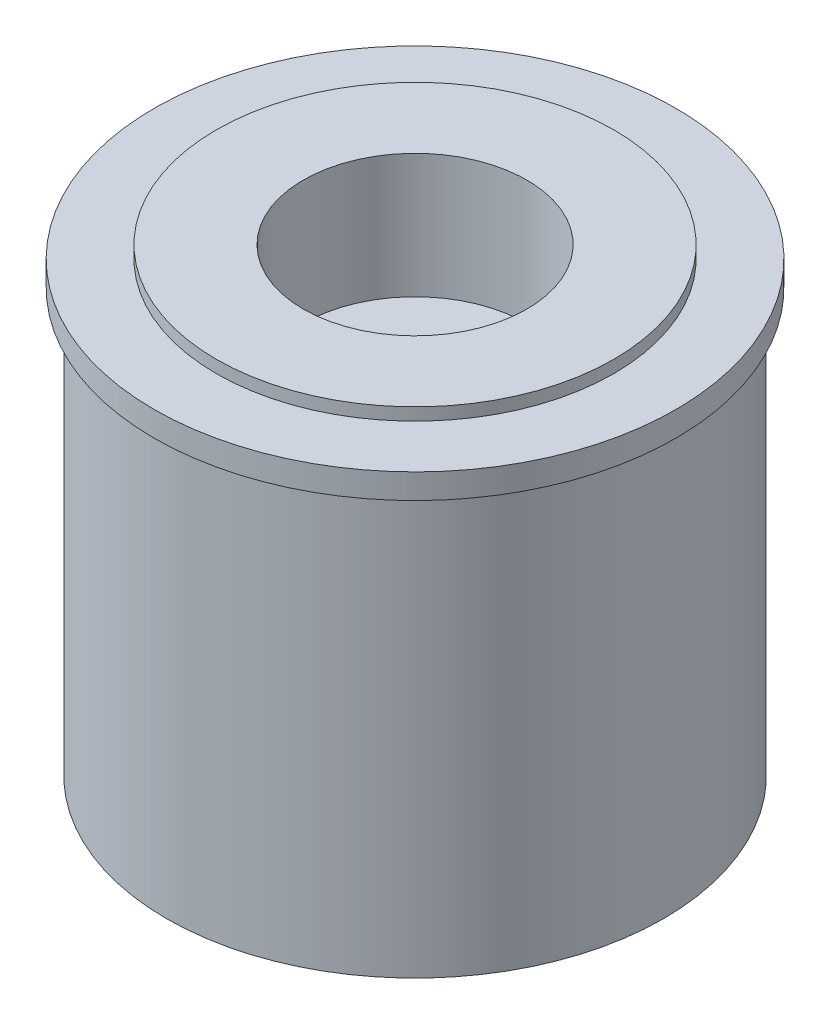
ISO-10303-21;
HEADER;
FILE_DESCRIPTION(('STEP AP214'),'2;1');
FILE_NAME('part.step','',(''),(''),'','','');
FILE_SCHEMA(('AUTOMOTIVE_DESIGN { 1 0 10303 214 1 1 1 1 }'));
ENDSEC;
DATA;
#1=APPLICATION_CONTEXT('core data for automotive mechanical design processes');
#2=APPLICATION_PROTOCOL_DEFINITION('international standard','automotive_design',2000,#1);
#3=PRODUCT_CONTEXT('',#1,'mechanical');
#4=PRODUCT('Part','Part','',(#3));
#5=PRODUCT_RELATED_PRODUCT_CATEGORY('part','',(#4));
#6=PRODUCT_DEFINITION_FORMATION('','',#4);
#7=PRODUCT_DEFINITION_CONTEXT('part definition',#1,'design');
#8=PRODUCT_DEFINITION('design','',#6,#7);
#9=PRODUCT_DEFINITION_SHAPE('','',#8);
#10=(LENGTH_UNIT() NAMED_UNIT(*) SI_UNIT(.MILLI.,.METRE.));
#11=(NAMED_UNIT(*) PLANE_ANGLE_UNIT() SI_UNIT($,.RADIAN.));
#12=(NAMED_UNIT(*) SI_UNIT($,.STERADIAN.) SOLID_ANGLE_UNIT());
#13=UNCERTAINTY_MEASURE_WITH_UNIT(LENGTH_MEASURE(1.E-05),#10,'distance_accuracy_value','');
#14=(GEOMETRIC_REPRESENTATION_CONTEXT(3) GLOBAL_UNCERTAINTY_ASSIGNED_CONTEXT((#13)) GLOBAL_UNIT_ASSIGNED_CONTEXT((#10,
#11,#12)) REPRESENTATION_CONTEXT('',''));
#15=CARTESIAN_POINT('',(0.,0.,0.));
#16=DIRECTION('',(0.,0.,1.));
#17=DIRECTION('',(1.,0.,0.));
#18=AXIS2_PLACEMENT_3D('',#15,#16,#17);
#19=CARTESIAN_POINT('',(0.,8.,0.));
#20=DIRECTION('',(0.,1.,0.));
#21=DIRECTION('',(0.,0.,1.));
#22=AXIS2_PLACEMENT_3D('',#19,#20,#21);
#23=PLANE('',#22);
#24=CARTESIAN_POINT('',(0.,8.,0.));
#25=DIRECTION('',(0.,1.,0.));
#26=DIRECTION('',(0.,0.,1.));
#27=AXIS2_PLACEMENT_3D('',#24,#25,#26);
#28=CIRCLE('',#27,8.);
#29=CARTESIAN_POINT('',(0.,8.,-8.));
#30=VERTEX_POINT('',#29);
#31=CARTESIAN_POINT('',(-8.,8.,0.));
#32=VERTEX_POINT('',#31);
#33=EDGE_CURVE('E283',#30,#32,#28,.T.);
#34=ORIENTED_EDGE('',*,*,#33,.F.);
#35=CARTESIAN_POINT('',(0.,8.,-6.));
#36=DIRECTION('',(0.,-1.,0.));
#37=DIRECTION('',(-1.,0.,0.));
#38=AXIS2_PLACEMENT_3D('',#35,#36,#37);
#39=CIRCLE('',#38,2.);
#40=EDGE_CURVE('E237',#30,#30,#39,.T.);
#41=ORIENTED_EDGE('',*,*,#40,.F.);
#42=CARTESIAN_POINT('',(8.,8.,0.));
#43=VERTEX_POINT('',#42);
#44=EDGE_CURVE('E279',#43,#30,#28,.T.);
#45=ORIENTED_EDGE('',*,*,#44,.F.);
#46=CARTESIAN_POINT('',(6.,8.,0.));
#47=DIRECTION('',(0.,-1.,0.));
#48=DIRECTION('',(0.,0.,-1.));
#49=AXIS2_PLACEMENT_3D('',#46,#47,#48);
#50=CIRCLE('',#49,2.);
#51=EDGE_CURVE('E260',#43,#43,#50,.T.);
#52=ORIENTED_EDGE('',*,*,#51,.F.);
#53=CARTESIAN_POINT('',(0.,8.,8.));
#54=VERTEX_POINT('',#53);
#55=EDGE_CURVE('E284',#54,#43,#28,.T.);
#56=ORIENTED_EDGE('',*,*,#55,.F.);
#57=CARTESIAN_POINT('',(0.,8.,6.));
#58=DIRECTION('',(0.,-1.,0.));
#59=DIRECTION('',(1.,0.,0.));
#60=AXIS2_PLACEMENT_3D('',#57,#58,#59);
#61=CIRCLE('',#60,2.);
#62=EDGE_CURVE('E254',#54,#54,#61,.T.);
#63=ORIENTED_EDGE('',*,*,#62,.F.);
#64=EDGE_CURVE('E655',#32,#54,#28,.T.);
#65=ORIENTED_EDGE('',*,*,#64,.F.);
#66=CARTESIAN_POINT('',(-6.,8.,0.));
#67=DIRECTION('',(0.,-1.,0.));
#68=DIRECTION('',(0.,0.,1.));
#69=AXIS2_PLACEMENT_3D('',#66,#67,#68);
#70=CIRCLE('',#69,2.);
#71=EDGE_CURVE('E248',#32,#32,#70,.T.);
#72=ORIENTED_EDGE('',*,*,#71,.F.);
#73=EDGE_LOOP('',(#34,#41,#45,#52,#56,#63,#65,#72));
#74=FACE_BOUND('',#73,.T.);
#75=ADVANCED_FACE('F31',(#74),#23,.F.);
#76=CARTESIAN_POINT('',(0.,17.,0.));
#77=DIRECTION('',(0.,-1.,0.));
#78=DIRECTION('',(0.,0.,-1.));
#79=AXIS2_PLACEMENT_3D('',#76,#77,#78);
#80=CYLINDRICAL_SURFACE('',#79,8.);
#81=CARTESIAN_POINT('',(0.,0.,0.));
#82=DIRECTION('',(0.,1.,0.));
#83=DIRECTION('',(0.,0.,1.));
#84=AXIS2_PLACEMENT_3D('',#81,#82,#83);
#85=CIRCLE('',#84,8.);
#86=CARTESIAN_POINT('',(0.,0.,8.));
#87=VERTEX_POINT('',#86);
#88=EDGE_CURVE('E287',#87,#87,#85,.T.);
#89=ORIENTED_EDGE('',*,*,#88,.F.);
#90=EDGE_LOOP('',(#89));
#91=FACE_BOUND('',#90,.T.);
#92=ORIENTED_EDGE('',*,*,#44,.T.);
#93=ORIENTED_EDGE('',*,*,#33,.T.);
#94=ORIENTED_EDGE('',*,*,#64,.T.);
#95=ORIENTED_EDGE('',*,*,#55,.T.);
#96=EDGE_LOOP('',(#92,#93,#94,#95));
#97=FACE_BOUND('',#96,.T.);
#98=ADVANCED_FACE('F350',(#91,#97),#80,.F.);
#99=CARTESIAN_POINT('',(0.,0.,0.));
#100=DIRECTION('',(0.,1.,0.));
#101=DIRECTION('',(0.,0.,1.));
#102=AXIS2_PLACEMENT_3D('',#99,#100,#101);
#103=PLANE('',#102);
#104=CARTESIAN_POINT('',(0.,0.,0.));
#105=DIRECTION('',(0.,1.,0.));
#106=DIRECTION('',(0.,0.,1.));
#107=AXIS2_PLACEMENT_3D('',#104,#105,#106);
#108=CIRCLE('',#107,10.);
#109=CARTESIAN_POINT('',(0.,0.,10.));
#110=VERTEX_POINT('',#109);
#111=EDGE_CURVE('E290',#110,#110,#108,.T.);
#112=ORIENTED_EDGE('',*,*,#111,.F.);
#113=EDGE_LOOP('',(#112));
#114=FACE_BOUND('',#113,.T.);
#115=ORIENTED_EDGE('',*,*,#88,.T.);
#116=EDGE_LOOP('',(#115));
#117=FACE_BOUND('',#116,.T.);
#118=ADVANCED_FACE('F357',(#114,#117),#103,.F.);
#119=CARTESIAN_POINT('',(0.,17.,0.));
#120=DIRECTION('',(0.,-1.,0.));
#121=DIRECTION('',(0.,0.,-1.));
#122=AXIS2_PLACEMENT_3D('',#119,#120,#121);
#123=CYLINDRICAL_SURFACE('',#122,10.);
#124=CARTESIAN_POINT('',(0.,17.,0.));
#125=DIRECTION('',(0.,1.,0.));
#126=DIRECTION('',(0.,0.,1.));
#127=AXIS2_PLACEMENT_3D('',#124,#125,#126);
#128=CIRCLE('',#127,10.);
#129=CARTESIAN_POINT('',(0.,17.,10.));
#130=VERTEX_POINT('',#129);
#131=EDGE_CURVE('E293',#130,#130,#128,.T.);
#132=ORIENTED_EDGE('',*,*,#131,.F.);
#133=EDGE_LOOP('',(#132));
#134=FACE_BOUND('',#133,.T.);
#135=ORIENTED_EDGE('',*,*,#111,.T.);
#136=EDGE_LOOP('',(#135));
#137=FACE_BOUND('',#136,.T.);
#138=ADVANCED_FACE('F33',(#134,#137),#123,.T.);
#139=CARTESIAN_POINT('',(0.,18.,0.));
#140=DIRECTION('',(0.,1.,0.));
#141=DIRECTION('',(0.,0.,1.));
#142=AXIS2_PLACEMENT_3D('',#139,#140,#141);
#143=PLANE('',#142);
#144=CARTESIAN_POINT('',(0.,18.,0.));
#145=DIRECTION('',(0.,1.,0.));
#146=DIRECTION('',(0.,0.,1.));
#147=AXIS2_PLACEMENT_3D('',#144,#145,#146);
#148=CIRCLE('',#147,10.5);
#149=CARTESIAN_POINT('',(0.,18.,10.5));
#150=VERTEX_POINT('',#149);
#151=EDGE_CURVE('E275',#150,#150,#148,.T.);
#152=ORIENTED_EDGE('',*,*,#151,.T.);
#153=EDGE_LOOP('',(#152));
#154=FACE_BOUND('',#153,.T.);
#155=CARTESIAN_POINT('',(0.,18.,0.));
#156=DIRECTION('',(0.,1.,0.));
#157=DIRECTION('',(0.,0.,1.));
#158=AXIS2_PLACEMENT_3D('',#155,#156,#157);
#159=CIRCLE('',#158,8.);
#160=CARTESIAN_POINT('',(0.,18.,8.));
#161=VERTEX_POINT('',#160);
#162=EDGE_CURVE('E278',#161,#161,#159,.T.);
#163=ORIENTED_EDGE('',*,*,#162,.F.);
#164=EDGE_LOOP('',(#163));
#165=FACE_BOUND('',#164,.T.);
#166=ADVANCED_FACE('F378',(#154,#165),#143,.T.);
#167=CARTESIAN_POINT('',(0.,17.,0.));
#168=DIRECTION('',(0.,1.,0.));
#169=DIRECTION('',(0.,0.,1.));
#170=AXIS2_PLACEMENT_3D('',#167,#168,#169);
#171=PLANE('',#170);
#172=CARTESIAN_POINT('',(0.,17.,0.));
#173=DIRECTION('',(0.,1.,0.));
#174=DIRECTION('',(0.,0.,1.));
#175=AXIS2_PLACEMENT_3D('',#172,#173,#174);
#176=CIRCLE('',#175,10.5);
#177=CARTESIAN_POINT('',(0.,17.,10.5));
#178=VERTEX_POINT('',#177);
#179=EDGE_CURVE('E272',#178,#178,#176,.T.);
#180=ORIENTED_EDGE('',*,*,#179,.F.);
#181=EDGE_LOOP('',(#180));
#182=FACE_BOUND('',#181,.T.);
#183=ORIENTED_EDGE('',*,*,#131,.T.);
#184=EDGE_LOOP('',(#183));
#185=FACE_BOUND('',#184,.T.);
#186=ADVANCED_FACE('F430',(#182,#185),#171,.F.);
#187=CARTESIAN_POINT('',(0.,18.,0.));
#188=DIRECTION('',(0.,-1.,0.));
#189=DIRECTION('',(0.,0.,-1.));
#190=AXIS2_PLACEMENT_3D('',#187,#188,#189);
#191=CYLINDRICAL_SURFACE('',#190,10.5);
#192=ORIENTED_EDGE('',*,*,#151,.F.);
#193=EDGE_LOOP('',(#192));
#194=FACE_BOUND('',#193,.T.);
#195=ORIENTED_EDGE('',*,*,#179,.T.);
#196=EDGE_LOOP('',(#195));
#197=FACE_BOUND('',#196,.T.);
#198=ADVANCED_FACE('F363',(#194,#197),#191,.T.);
#199=CARTESIAN_POINT('',(0.,18.5,0.));
#200=DIRECTION('',(0.,1.,0.));
#201=DIRECTION('',(0.,0.,1.));
#202=AXIS2_PLACEMENT_3D('',#199,#200,#201);
#203=PLANE('',#202);
#204=CARTESIAN_POINT('',(0.,18.5,0.));
#205=DIRECTION('',(0.,1.,0.));
#206=DIRECTION('',(0.,0.,1.));
#207=AXIS2_PLACEMENT_3D('',#204,#205,#206);
#208=CIRCLE('',#207,4.5);
#209=CARTESIAN_POINT('',(0.,18.5,4.5));
#210=VERTEX_POINT('',#209);
#211=EDGE_CURVE('E266',#210,#210,#208,.T.);
#212=ORIENTED_EDGE('',*,*,#211,.F.);
#213=EDGE_LOOP('',(#212));
#214=FACE_BOUND('',#213,.T.);
#215=CARTESIAN_POINT('',(0.,18.5,0.));
#216=DIRECTION('',(0.,1.,0.));
#217=DIRECTION('',(0.,0.,1.));
#218=AXIS2_PLACEMENT_3D('',#215,#216,#217);
#219=CIRCLE('',#218,8.);
#220=CARTESIAN_POINT('',(0.,18.5,8.));
#221=VERTEX_POINT('',#220);
#222=EDGE_CURVE('E282',#221,#221,#219,.T.);
#223=ORIENTED_EDGE('',*,*,#222,.T.);
#224=EDGE_LOOP('',(#223));
#225=FACE_BOUND('',#224,.T.);
#226=ADVANCED_FACE('F365',(#214,#225),#203,.T.);
#227=CARTESIAN_POINT('',(0.,18.5,0.));
#228=DIRECTION('',(0.,-1.,0.));
#229=DIRECTION('',(0.,0.,-1.));
#230=AXIS2_PLACEMENT_3D('',#227,#228,#229);
#231=CYLINDRICAL_SURFACE('',#230,8.);
#232=ORIENTED_EDGE('',*,*,#162,.T.);
#233=EDGE_LOOP('',(#232));
#234=FACE_BOUND('',#233,.T.);
#235=ORIENTED_EDGE('',*,*,#222,.F.);
#236=EDGE_LOOP('',(#235));
#237=FACE_BOUND('',#236,.T.);
#238=ADVANCED_FACE('F368',(#234,#237),#231,.T.);
#239=CARTESIAN_POINT('',(0.,13.5,0.));
#240=DIRECTION('',(0.,1.,0.));
#241=DIRECTION('',(0.,0.,1.));
#242=AXIS2_PLACEMENT_3D('',#239,#240,#241);
#243=CYLINDRICAL_SURFACE('',#242,4.5);
#244=CARTESIAN_POINT('',(0.,13.5,0.));
#245=DIRECTION('',(0.,1.,0.));
#246=DIRECTION('',(0.,0.,1.));
#247=AXIS2_PLACEMENT_3D('',#244,#245,#246);
#248=CIRCLE('',#247,4.5);
#249=CARTESIAN_POINT('',(0.,13.5,4.5));
#250=VERTEX_POINT('',#249);
#251=EDGE_CURVE('E269',#250,#250,#248,.T.);
#252=ORIENTED_EDGE('',*,*,#251,.F.);
#253=EDGE_LOOP('',(#252));
#254=FACE_BOUND('',#253,.T.);
#255=ORIENTED_EDGE('',*,*,#211,.T.);
#256=EDGE_LOOP('',(#255));
#257=FACE_BOUND('',#256,.T.);
#258=ADVANCED_FACE('F371',(#254,#257),#243,.F.);
#259=CARTESIAN_POINT('',(0.,13.5,0.));
#260=DIRECTION('',(0.,1.,0.));
#261=DIRECTION('',(0.,0.,1.));
#262=AXIS2_PLACEMENT_3D('',#259,#260,#261);
#263=PLANE('',#262);
#264=DIRECTION('',(-1.,0.,0.));
#265=VECTOR('',#264,1.);
#266=CARTESIAN_POINT('',(-0.199999999999964,13.5,-4.45958797096475));
#267=LINE('',#266,#265);
#268=CARTESIAN_POINT('',(0.20000000000005,13.5,-4.45958797096475));
#269=VERTEX_POINT('',#268);
#270=CARTESIAN_POINT('',(-0.199999999999964,13.5,-4.45958797096475));
#271=VERTEX_POINT('',#270);
#272=EDGE_CURVE('E46',#269,#271,#267,.T.);
#273=ORIENTED_EDGE('',*,*,#272,.F.);
#274=DIRECTION('',(0.,0.,-1.));
#275=VECTOR('',#274,1.);
#276=CARTESIAN_POINT('',(0.20000000000005,13.5,-4.45958797096475));
#277=LINE('',#276,#275);
#278=CARTESIAN_POINT('',(0.200000000000046,13.5,-4.05958797096475));
#279=VERTEX_POINT('',#278);
#280=EDGE_CURVE('E174',#279,#269,#277,.T.);
#281=ORIENTED_EDGE('',*,*,#280,.F.);
#282=DIRECTION('',(1.,0.,0.));
#283=VECTOR('',#282,1.);
#284=CARTESIAN_POINT('',(-0.199999999999961,13.5,-4.05958797096475));
#285=LINE('',#284,#283);
#286=CARTESIAN_POINT('',(-0.199999999999961,13.5,-4.05958797096475));
#287=VERTEX_POINT('',#286);
#288=EDGE_CURVE('E158',#287,#279,#285,.T.);
#289=ORIENTED_EDGE('',*,*,#288,.F.);
#290=DIRECTION('',(0.,0.,1.));
#291=VECTOR('',#290,1.);
#292=CARTESIAN_POINT('',(-0.199999999999964,13.5,-4.45958797096475));
#293=LINE('',#292,#291);
#294=EDGE_CURVE('E167',#271,#287,#293,.T.);
#295=ORIENTED_EDGE('',*,*,#294,.F.);
#296=EDGE_LOOP('',(#273,#281,#289,#295));
#297=FACE_BOUND('',#296,.T.);
#298=DIRECTION('',(0.,0.,1.));
#299=VECTOR('',#298,1.);
#300=CARTESIAN_POINT('',(-4.45958797096475,13.5,0.19999999999998));
#301=LINE('',#300,#299);
#302=CARTESIAN_POINT('',(-4.45958797096475,13.5,-0.200000000000035));
#303=VERTEX_POINT('',#302);
#304=CARTESIAN_POINT('',(-4.45958797096475,13.5,0.19999999999998));
#305=VERTEX_POINT('',#304);
#306=EDGE_CURVE('E181',#303,#305,#301,.T.);
#307=ORIENTED_EDGE('',*,*,#306,.F.);
#308=DIRECTION('',(-1.,0.,0.));
#309=VECTOR('',#308,1.);
#310=CARTESIAN_POINT('',(-4.45958797096475,13.5,-0.200000000000035));
#311=LINE('',#310,#309);
#312=CARTESIAN_POINT('',(-4.05958797096475,13.5,-0.200000000000032));
#313=VERTEX_POINT('',#312);
#314=EDGE_CURVE('E191',#313,#303,#311,.T.);
#315=ORIENTED_EDGE('',*,*,#314,.F.);
#316=DIRECTION('',(0.,0.,-1.));
#317=VECTOR('',#316,1.);
#318=CARTESIAN_POINT('',(-4.05958797096475,13.5,0.199999999999975));
#319=LINE('',#318,#317);
#320=CARTESIAN_POINT('',(-4.05958797096475,13.5,0.199999999999975));
#321=VERTEX_POINT('',#320);
#322=EDGE_CURVE('E188',#321,#313,#319,.T.);
#323=ORIENTED_EDGE('',*,*,#322,.F.);
#324=DIRECTION('',(1.,0.,0.));
#325=VECTOR('',#324,1.);
#326=CARTESIAN_POINT('',(-4.45958797096475,13.5,0.19999999999998));
#327=LINE('',#326,#325);
#328=EDGE_CURVE('E185',#305,#321,#327,.T.);
#329=ORIENTED_EDGE('',*,*,#328,.F.);
#330=EDGE_LOOP('',(#307,#315,#323,#329));
#331=FACE_BOUND('',#330,.T.);
#332=DIRECTION('',(1.,0.,0.));
#333=VECTOR('',#332,1.);
#334=CARTESIAN_POINT('',(0.199999999999995,13.5,4.45958797096475));
#335=LINE('',#334,#333);
#336=CARTESIAN_POINT('',(-0.200000000000019,13.5,4.45958797096475));
#337=VERTEX_POINT('',#336);
#338=CARTESIAN_POINT('',(0.199999999999995,13.5,4.45958797096475));
#339=VERTEX_POINT('',#338);
#340=EDGE_CURVE('E197',#337,#339,#335,.T.);
#341=ORIENTED_EDGE('',*,*,#340,.F.);
#342=DIRECTION('',(0.,0.,1.));
#343=VECTOR('',#342,1.);
#344=CARTESIAN_POINT('',(-0.200000000000019,13.5,4.45958797096475));
#345=LINE('',#344,#343);
#346=CARTESIAN_POINT('',(-0.200000000000018,13.5,4.05958797096475));
#347=VERTEX_POINT('',#346);
#348=EDGE_CURVE('E211',#347,#337,#345,.T.);
#349=ORIENTED_EDGE('',*,*,#348,.F.);
#350=DIRECTION('',(-1.,0.,0.));
#351=VECTOR('',#350,1.);
#352=CARTESIAN_POINT('',(0.199999999999989,13.5,4.05958797096475));
#353=LINE('',#352,#351);
#354=CARTESIAN_POINT('',(0.199999999999989,13.5,4.05958797096475));
#355=VERTEX_POINT('',#354);
#356=EDGE_CURVE('E208',#355,#347,#353,.T.);
#357=ORIENTED_EDGE('',*,*,#356,.F.);
#358=DIRECTION('',(0.,0.,-1.));
#359=VECTOR('',#358,1.);
#360=CARTESIAN_POINT('',(0.199999999999995,13.5,4.45958797096475));
#361=LINE('',#360,#359);
#362=EDGE_CURVE('E205',#339,#355,#361,.T.);
#363=ORIENTED_EDGE('',*,*,#362,.F.);
#364=EDGE_LOOP('',(#341,#349,#357,#363));
#365=FACE_BOUND('',#364,.T.);
#366=DIRECTION('',(0.,0.,-1.));
#367=VECTOR('',#366,1.);
#368=CARTESIAN_POINT('',(4.45958797096475,13.5,-0.200000000000011));
#369=LINE('',#368,#367);
#370=CARTESIAN_POINT('',(4.45958797096475,13.5,0.200000000000004));
#371=VERTEX_POINT('',#370);
#372=CARTESIAN_POINT('',(4.45958797096475,13.5,-0.200000000000011));
#373=VERTEX_POINT('',#372);
#374=EDGE_CURVE('E217',#371,#373,#369,.T.);
#375=ORIENTED_EDGE('',*,*,#374,.F.);
#376=DIRECTION('',(1.,0.,0.));
#377=VECTOR('',#376,1.);
#378=CARTESIAN_POINT('',(4.45958797096475,13.5,0.200000000000004));
#379=LINE('',#378,#377);
#380=CARTESIAN_POINT('',(4.05958797096475,13.5,0.200000000000004));
#381=VERTEX_POINT('',#380);
#382=EDGE_CURVE('E231',#381,#371,#379,.T.);
#383=ORIENTED_EDGE('',*,*,#382,.F.);
#384=DIRECTION('',(0.,0.,1.));
#385=VECTOR('',#384,1.);
#386=CARTESIAN_POINT('',(4.05958797096475,13.5,-0.200000000000004));
#387=LINE('',#386,#385);
#388=CARTESIAN_POINT('',(4.05958797096475,13.5,-0.200000000000004));
#389=VERTEX_POINT('',#388);
#390=EDGE_CURVE('E228',#389,#381,#387,.T.);
#391=ORIENTED_EDGE('',*,*,#390,.F.);
#392=DIRECTION('',(-1.,0.,0.));
#393=VECTOR('',#392,1.);
#394=CARTESIAN_POINT('',(4.45958797096475,13.5,-0.200000000000011));
#395=LINE('',#394,#393);
#396=EDGE_CURVE('E225',#373,#389,#395,.T.);
#397=ORIENTED_EDGE('',*,*,#396,.F.);
#398=EDGE_LOOP('',(#375,#383,#391,#397));
#399=FACE_BOUND('',#398,.T.);
#400=ORIENTED_EDGE('',*,*,#251,.T.);
#401=EDGE_LOOP('',(#400));
#402=FACE_BOUND('',#401,.T.);
#403=ADVANCED_FACE('F171',(#297,#331,#365,#399,#402),#263,.T.);
#404=CARTESIAN_POINT('',(6.,13.,0.));
#405=DIRECTION('',(0.,-1.,0.));
#406=DIRECTION('',(0.,0.,-1.));
#407=AXIS2_PLACEMENT_3D('',#404,#405,#406);
#408=CYLINDRICAL_SURFACE('',#407,2.);
#409=CARTESIAN_POINT('',(6.,13.,0.));
#410=DIRECTION('',(0.,-1.,0.));
#411=DIRECTION('',(0.,0.,-1.));
#412=AXIS2_PLACEMENT_3D('',#409,#410,#411);
#413=CIRCLE('',#412,2.);
#414=CARTESIAN_POINT('',(6.,13.,-2.));
#415=VERTEX_POINT('',#414);
#416=EDGE_CURVE('E263',#415,#415,#413,.T.);
#417=ORIENTED_EDGE('',*,*,#416,.F.);
#418=EDGE_LOOP('',(#417));
#419=FACE_BOUND('',#418,.T.);
#420=ORIENTED_EDGE('',*,*,#51,.T.);
#421=EDGE_LOOP('',(#420));
#422=FACE_BOUND('',#421,.T.);
#423=ADVANCED_FACE('F421',(#419,#422),#408,.F.);
#424=CARTESIAN_POINT('',(6.,13.,0.));
#425=DIRECTION('',(0.,-1.,0.));
#426=DIRECTION('',(0.,0.,-1.));
#427=AXIS2_PLACEMENT_3D('',#424,#425,#426);
#428=PLANE('',#427);
#429=DIRECTION('',(0.,0.,1.));
#430=VECTOR('',#429,1.);
#431=CARTESIAN_POINT('',(4.45958797096475,13.,0.));
#432=LINE('',#431,#430);
#433=CARTESIAN_POINT('',(4.45958797096475,13.,-0.200000000000011));
#434=VERTEX_POINT('',#433);
#435=CARTESIAN_POINT('',(4.45958797096475,13.,0.200000000000004));
#436=VERTEX_POINT('',#435);
#437=EDGE_CURVE('E305',#434,#436,#432,.T.);
#438=ORIENTED_EDGE('',*,*,#437,.F.);
#439=DIRECTION('',(1.,0.,0.));
#440=VECTOR('',#439,1.);
#441=CARTESIAN_POINT('',(6.,13.,-0.200000000000039));
#442=LINE('',#441,#440);
#443=CARTESIAN_POINT('',(4.05958797096475,13.,-0.200000000000004));
#444=VERTEX_POINT('',#443);
#445=EDGE_CURVE('E296',#444,#434,#442,.T.);
#446=ORIENTED_EDGE('',*,*,#445,.F.);
#447=DIRECTION('',(0.,0.,-1.));
#448=VECTOR('',#447,1.);
#449=CARTESIAN_POINT('',(4.05958797096475,13.,0.));
#450=LINE('',#449,#448);
#451=CARTESIAN_POINT('',(4.05958797096475,13.,0.200000000000004));
#452=VERTEX_POINT('',#451);
#453=EDGE_CURVE('E300',#452,#444,#450,.T.);
#454=ORIENTED_EDGE('',*,*,#453,.F.);
#455=DIRECTION('',(-1.,0.,0.));
#456=VECTOR('',#455,1.);
#457=CARTESIAN_POINT('',(6.,13.,0.200000000000004));
#458=LINE('',#457,#456);
#459=EDGE_CURVE('E303',#436,#452,#458,.T.);
#460=ORIENTED_EDGE('',*,*,#459,.F.);
#461=EDGE_LOOP('',(#438,#446,#454,#460));
#462=FACE_BOUND('',#461,.T.);
#463=ORIENTED_EDGE('',*,*,#416,.T.);
#464=EDGE_LOOP('',(#463));
#465=FACE_BOUND('',#464,.T.);
#466=ADVANCED_FACE('F418',(#462,#465),#428,.T.);
#467=CARTESIAN_POINT('',(0.,13.,6.));
#468=DIRECTION('',(0.,-1.,0.));
#469=DIRECTION('',(0.,0.,-1.));
#470=AXIS2_PLACEMENT_3D('',#467,#468,#469);
#471=CYLINDRICAL_SURFACE('',#470,2.);
#472=CARTESIAN_POINT('',(0.,13.,6.));
#473=DIRECTION('',(0.,-1.,0.));
#474=DIRECTION('',(1.,0.,0.));
#475=AXIS2_PLACEMENT_3D('',#472,#473,#474);
#476=CIRCLE('',#475,2.);
#477=CARTESIAN_POINT('',(1.99999999999998,13.,6.00000000000001));
#478=VERTEX_POINT('',#477);
#479=EDGE_CURVE('E257',#478,#478,#476,.T.);
#480=ORIENTED_EDGE('',*,*,#479,.F.);
#481=EDGE_LOOP('',(#480));
#482=FACE_BOUND('',#481,.T.);
#483=ORIENTED_EDGE('',*,*,#62,.T.);
#484=EDGE_LOOP('',(#483));
#485=FACE_BOUND('',#484,.T.);
#486=ADVANCED_FACE('F414',(#482,#485),#471,.F.);
#487=CARTESIAN_POINT('',(0.,13.,6.));
#488=DIRECTION('',(0.,-1.,0.));
#489=DIRECTION('',(1.,0.,0.));
#490=AXIS2_PLACEMENT_3D('',#487,#488,#489);
#491=PLANE('',#490);
#492=DIRECTION('',(-1.,0.,0.));
#493=VECTOR('',#492,1.);
#494=CARTESIAN_POINT('',(0.,13.,4.45958797096475));
#495=LINE('',#494,#493);
#496=CARTESIAN_POINT('',(0.199999999999995,13.,4.45958797096475));
#497=VERTEX_POINT('',#496);
#498=CARTESIAN_POINT('',(-0.200000000000019,13.,4.45958797096475));
#499=VERTEX_POINT('',#498);
#500=EDGE_CURVE('E314',#497,#499,#495,.T.);
#501=ORIENTED_EDGE('',*,*,#500,.F.);
#502=DIRECTION('',(0.,0.,1.));
#503=VECTOR('',#502,1.);
#504=CARTESIAN_POINT('',(0.200000000000018,13.,6.));
#505=LINE('',#504,#503);
#506=CARTESIAN_POINT('',(0.199999999999989,13.,4.05958797096475));
#507=VERTEX_POINT('',#506);
#508=EDGE_CURVE('E307',#507,#497,#505,.T.);
#509=ORIENTED_EDGE('',*,*,#508,.F.);
#510=DIRECTION('',(1.,0.,0.));
#511=VECTOR('',#510,1.);
#512=CARTESIAN_POINT('',(0.,13.,4.05958797096475));
#513=LINE('',#512,#511);
#514=CARTESIAN_POINT('',(-0.200000000000018,13.,4.05958797096475));
#515=VERTEX_POINT('',#514);
#516=EDGE_CURVE('E309',#515,#507,#513,.T.);
#517=ORIENTED_EDGE('',*,*,#516,.F.);
#518=DIRECTION('',(0.,0.,-1.));
#519=VECTOR('',#518,1.);
#520=CARTESIAN_POINT('',(-0.200000000000025,13.,6.));
#521=LINE('',#520,#519);
#522=EDGE_CURVE('E312',#499,#515,#521,.T.);
#523=ORIENTED_EDGE('',*,*,#522,.F.);
#524=EDGE_LOOP('',(#501,#509,#517,#523));
#525=FACE_BOUND('',#524,.T.);
#526=ORIENTED_EDGE('',*,*,#479,.T.);
#527=EDGE_LOOP('',(#526));
#528=FACE_BOUND('',#527,.T.);
#529=ADVANCED_FACE('F410',(#525,#528),#491,.T.);
#530=CARTESIAN_POINT('',(-6.,13.,0.));
#531=DIRECTION('',(0.,-1.,0.));
#532=DIRECTION('',(0.,0.,-1.));
#533=AXIS2_PLACEMENT_3D('',#530,#531,#532);
#534=CYLINDRICAL_SURFACE('',#533,2.);
#535=CARTESIAN_POINT('',(-6.,13.,0.));
#536=DIRECTION('',(0.,-1.,0.));
#537=DIRECTION('',(0.,0.,1.));
#538=AXIS2_PLACEMENT_3D('',#535,#536,#537);
#539=CIRCLE('',#538,2.);
#540=CARTESIAN_POINT('',(-6.00000000000001,13.,1.99999999999996));
#541=VERTEX_POINT('',#540);
#542=EDGE_CURVE('E251',#541,#541,#539,.T.);
#543=ORIENTED_EDGE('',*,*,#542,.F.);
#544=EDGE_LOOP('',(#543));
#545=FACE_BOUND('',#544,.T.);
#546=ORIENTED_EDGE('',*,*,#71,.T.);
#547=EDGE_LOOP('',(#546));
#548=FACE_BOUND('',#547,.T.);
#549=ADVANCED_FACE('F403',(#545,#548),#534,.F.);
#550=CARTESIAN_POINT('',(-6.,13.,0.));
#551=DIRECTION('',(0.,-1.,0.));
#552=DIRECTION('',(0.,0.,1.));
#553=AXIS2_PLACEMENT_3D('',#550,#551,#552);
#554=PLANE('',#553);
#555=DIRECTION('',(0.,0.,-1.));
#556=VECTOR('',#555,1.);
#557=CARTESIAN_POINT('',(-4.45958797096475,13.,0.));
#558=LINE('',#557,#556);
#559=CARTESIAN_POINT('',(-4.45958797096475,13.,0.19999999999998));
#560=VERTEX_POINT('',#559);
#561=CARTESIAN_POINT('',(-4.45958797096475,13.,-0.200000000000035));
#562=VERTEX_POINT('',#561);
#563=EDGE_CURVE('E323',#560,#562,#558,.T.);
#564=ORIENTED_EDGE('',*,*,#563,.F.);
#565=DIRECTION('',(-1.,0.,0.));
#566=VECTOR('',#565,1.);
#567=CARTESIAN_POINT('',(-6.,13.,0.199999999999997));
#568=LINE('',#567,#566);
#569=CARTESIAN_POINT('',(-4.05958797096475,13.,0.199999999999975));
#570=VERTEX_POINT('',#569);
#571=EDGE_CURVE('E316',#570,#560,#568,.T.);
#572=ORIENTED_EDGE('',*,*,#571,.F.);
#573=DIRECTION('',(0.,0.,1.));
#574=VECTOR('',#573,1.);
#575=CARTESIAN_POINT('',(-4.05958797096475,13.,0.));
#576=LINE('',#575,#574);
#577=CARTESIAN_POINT('',(-4.05958797096475,13.,-0.200000000000032));
#578=VERTEX_POINT('',#577);
#579=EDGE_CURVE('E318',#578,#570,#576,.T.);
#580=ORIENTED_EDGE('',*,*,#579,.F.);
#581=DIRECTION('',(1.,0.,0.));
#582=VECTOR('',#581,1.);
#583=CARTESIAN_POINT('',(-6.,13.,-0.200000000000046));
#584=LINE('',#583,#582);
#585=EDGE_CURVE('E321',#562,#578,#584,.T.);
#586=ORIENTED_EDGE('',*,*,#585,.F.);
#587=EDGE_LOOP('',(#564,#572,#580,#586));
#588=FACE_BOUND('',#587,.T.);
#589=ORIENTED_EDGE('',*,*,#542,.T.);
#590=EDGE_LOOP('',(#589));
#591=FACE_BOUND('',#590,.T.);
#592=ADVANCED_FACE('F392',(#588,#591),#554,.T.);
#593=CARTESIAN_POINT('',(0.,13.,-6.));
#594=DIRECTION('',(0.,-1.,0.));
#595=DIRECTION('',(0.,0.,-1.));
#596=AXIS2_PLACEMENT_3D('',#593,#594,#595);
#597=CYLINDRICAL_SURFACE('',#596,2.);
#598=CARTESIAN_POINT('',(0.,13.,-6.));
#599=DIRECTION('',(0.,-1.,0.));
#600=DIRECTION('',(-1.,0.,0.));
#601=AXIS2_PLACEMENT_3D('',#598,#599,#600);
#602=CIRCLE('',#601,2.);
#603=CARTESIAN_POINT('',(-1.99999999999994,13.,-6.00000000000002));
#604=VERTEX_POINT('',#603);
#605=EDGE_CURVE('E245',#604,#604,#602,.T.);
#606=ORIENTED_EDGE('',*,*,#605,.F.);
#607=EDGE_LOOP('',(#606));
#608=FACE_BOUND('',#607,.T.);
#609=ORIENTED_EDGE('',*,*,#40,.T.);
#610=EDGE_LOOP('',(#609));
#611=FACE_BOUND('',#610,.T.);
#612=ADVANCED_FACE('F390',(#608,#611),#597,.F.);
#613=CARTESIAN_POINT('',(0.,13.,-6.));
#614=DIRECTION('',(0.,-1.,0.));
#615=DIRECTION('',(-1.,0.,0.));
#616=AXIS2_PLACEMENT_3D('',#613,#614,#615);
#617=PLANE('',#616);
#618=DIRECTION('',(1.,0.,0.));
#619=VECTOR('',#618,1.);
#620=CARTESIAN_POINT('',(0.,13.,-4.45958797096475));
#621=LINE('',#620,#619);
#622=CARTESIAN_POINT('',(-0.199999999999964,13.,-4.45958797096475));
#623=VERTEX_POINT('',#622);
#624=CARTESIAN_POINT('',(0.20000000000005,13.,-4.45958797096475));
#625=VERTEX_POINT('',#624);
#626=EDGE_CURVE('E11',#623,#625,#621,.T.);
#627=ORIENTED_EDGE('',*,*,#626,.F.);
#628=DIRECTION('',(0.,0.,-1.));
#629=VECTOR('',#628,1.);
#630=CARTESIAN_POINT('',(-0.199999999999976,13.,-6.));
#631=LINE('',#630,#629);
#632=CARTESIAN_POINT('',(-0.199999999999961,13.,-4.05958797096475));
#633=VERTEX_POINT('',#632);
#634=EDGE_CURVE('E325',#633,#623,#631,.T.);
#635=ORIENTED_EDGE('',*,*,#634,.F.);
#636=DIRECTION('',(-1.,0.,0.));
#637=VECTOR('',#636,1.);
#638=CARTESIAN_POINT('',(0.,13.,-4.05958797096475));
#639=LINE('',#638,#637);
#640=CARTESIAN_POINT('',(0.200000000000046,13.,-4.05958797096475));
#641=VERTEX_POINT('',#640);
#642=EDGE_CURVE('E161',#641,#633,#639,.T.);
#643=ORIENTED_EDGE('',*,*,#642,.F.);
#644=DIRECTION('',(0.,0.,1.));
#645=VECTOR('',#644,1.);
#646=CARTESIAN_POINT('',(0.200000000000066,13.,-6.));
#647=LINE('',#646,#645);
#648=EDGE_CURVE('E39',#625,#641,#647,.T.);
#649=ORIENTED_EDGE('',*,*,#648,.F.);
#650=EDGE_LOOP('',(#627,#635,#643,#649));
#651=FACE_BOUND('',#650,.T.);
#652=ORIENTED_EDGE('',*,*,#605,.T.);
#653=EDGE_LOOP('',(#652));
#654=FACE_BOUND('',#653,.T.);
#655=ADVANCED_FACE('F333',(#651,#654),#617,.T.);
#656=CARTESIAN_POINT('',(4.45958797096475,0.,-0.200000000000011));
#657=DIRECTION('',(1.,0.,0.));
#658=DIRECTION('',(0.,0.,-1.));
#659=AXIS2_PLACEMENT_3D('',#656,#657,#658);
#660=PLANE('',#659);
#661=ORIENTED_EDGE('',*,*,#437,.T.);
#662=DIRECTION('',(0.,1.,0.));
#663=VECTOR('',#662,1.);
#664=CARTESIAN_POINT('',(4.45958797096475,0.,0.200000000000004));
#665=LINE('',#664,#663);
#666=EDGE_CURVE('E235',#436,#371,#665,.T.);
#667=ORIENTED_EDGE('',*,*,#666,.T.);
#668=ORIENTED_EDGE('',*,*,#374,.T.);
#669=DIRECTION('',(0.,1.,0.));
#670=VECTOR('',#669,1.);
#671=CARTESIAN_POINT('',(4.45958797096475,0.,-0.200000000000011));
#672=LINE('',#671,#670);
#673=EDGE_CURVE('E234',#434,#373,#672,.T.);
#674=ORIENTED_EDGE('',*,*,#673,.F.);
#675=EDGE_LOOP('',(#661,#667,#668,#674));
#676=FACE_BOUND('',#675,.T.);
#677=ADVANCED_FACE('F400',(#676),#660,.F.);
#678=CARTESIAN_POINT('',(4.45958797096475,0.,0.200000000000004));
#679=DIRECTION('',(0.,0.,1.));
#680=DIRECTION('',(1.,0.,0.));
#681=AXIS2_PLACEMENT_3D('',#678,#679,#680);
#682=PLANE('',#681);
#683=ORIENTED_EDGE('',*,*,#459,.T.);
#684=DIRECTION('',(0.,1.,0.));
#685=VECTOR('',#684,1.);
#686=CARTESIAN_POINT('',(4.05958797096475,0.,0.200000000000004));
#687=LINE('',#686,#685);
#688=EDGE_CURVE('E238',#452,#381,#687,.T.);
#689=ORIENTED_EDGE('',*,*,#688,.T.);
#690=ORIENTED_EDGE('',*,*,#382,.T.);
#691=ORIENTED_EDGE('',*,*,#666,.F.);
#692=EDGE_LOOP('',(#683,#689,#690,#691));
#693=FACE_BOUND('',#692,.T.);
#694=ADVANCED_FACE('F508',(#693),#682,.F.);
#695=CARTESIAN_POINT('',(4.05958797096475,0.,-0.200000000000004));
#696=DIRECTION('',(-1.,0.,0.));
#697=DIRECTION('',(0.,0.,1.));
#698=AXIS2_PLACEMENT_3D('',#695,#696,#697);
#699=PLANE('',#698);
#700=ORIENTED_EDGE('',*,*,#453,.T.);
#701=DIRECTION('',(0.,1.,0.));
#702=VECTOR('',#701,1.);
#703=CARTESIAN_POINT('',(4.05958797096475,0.,-0.200000000000004));
#704=LINE('',#703,#702);
#705=EDGE_CURVE('E240',#444,#389,#704,.T.);
#706=ORIENTED_EDGE('',*,*,#705,.T.);
#707=ORIENTED_EDGE('',*,*,#390,.T.);
#708=ORIENTED_EDGE('',*,*,#688,.F.);
#709=EDGE_LOOP('',(#700,#706,#707,#708));
#710=FACE_BOUND('',#709,.T.);
#711=ADVANCED_FACE('F515',(#710),#699,.F.);
#712=CARTESIAN_POINT('',(4.45958797096475,0.,-0.200000000000011));
#713=DIRECTION('',(0.,0.,-1.));
#714=DIRECTION('',(-1.,0.,0.));
#715=AXIS2_PLACEMENT_3D('',#712,#713,#714);
#716=PLANE('',#715);
#717=ORIENTED_EDGE('',*,*,#445,.T.);
#718=ORIENTED_EDGE('',*,*,#673,.T.);
#719=ORIENTED_EDGE('',*,*,#396,.T.);
#720=ORIENTED_EDGE('',*,*,#705,.F.);
#721=EDGE_LOOP('',(#717,#718,#719,#720));
#722=FACE_BOUND('',#721,.T.);
#723=ADVANCED_FACE('F523',(#722),#716,.F.);
#724=CARTESIAN_POINT('',(0.199999999999995,0.,4.45958797096475));
#725=DIRECTION('',(0.,0.,1.));
#726=DIRECTION('',(1.,0.,0.));
#727=AXIS2_PLACEMENT_3D('',#724,#725,#726);
#728=PLANE('',#727);
#729=ORIENTED_EDGE('',*,*,#500,.T.);
#730=DIRECTION('',(0.,1.,0.));
#731=VECTOR('',#730,1.);
#732=CARTESIAN_POINT('',(-0.200000000000019,0.,4.45958797096475));
#733=LINE('',#732,#731);
#734=EDGE_CURVE('E215',#499,#337,#733,.T.);
#735=ORIENTED_EDGE('',*,*,#734,.T.);
#736=ORIENTED_EDGE('',*,*,#340,.T.);
#737=DIRECTION('',(0.,1.,0.));
#738=VECTOR('',#737,1.);
#739=CARTESIAN_POINT('',(0.199999999999995,0.,4.45958797096475));
#740=LINE('',#739,#738);
#741=EDGE_CURVE('E214',#497,#339,#740,.T.);
#742=ORIENTED_EDGE('',*,*,#741,.F.);
#743=EDGE_LOOP('',(#729,#735,#736,#742));
#744=FACE_BOUND('',#743,.T.);
#745=ADVANCED_FACE('F531',(#744),#728,.F.);
#746=CARTESIAN_POINT('',(-0.200000000000019,0.,4.45958797096475));
#747=DIRECTION('',(-1.,0.,0.));
#748=DIRECTION('',(0.,0.,1.));
#749=AXIS2_PLACEMENT_3D('',#746,#747,#748);
#750=PLANE('',#749);
#751=ORIENTED_EDGE('',*,*,#522,.T.);
#752=DIRECTION('',(0.,1.,0.));
#753=VECTOR('',#752,1.);
#754=CARTESIAN_POINT('',(-0.200000000000018,0.,4.05958797096475));
#755=LINE('',#754,#753);
#756=EDGE_CURVE('E218',#515,#347,#755,.T.);
#757=ORIENTED_EDGE('',*,*,#756,.T.);
#758=ORIENTED_EDGE('',*,*,#348,.T.);
#759=ORIENTED_EDGE('',*,*,#734,.F.);
#760=EDGE_LOOP('',(#751,#757,#758,#759));
#761=FACE_BOUND('',#760,.T.);
#762=ADVANCED_FACE('F538',(#761),#750,.F.);
#763=CARTESIAN_POINT('',(0.199999999999989,0.,4.05958797096475));
#764=DIRECTION('',(0.,0.,-1.));
#765=DIRECTION('',(-1.,0.,0.));
#766=AXIS2_PLACEMENT_3D('',#763,#764,#765);
#767=PLANE('',#766);
#768=ORIENTED_EDGE('',*,*,#516,.T.);
#769=DIRECTION('',(0.,1.,0.));
#770=VECTOR('',#769,1.);
#771=CARTESIAN_POINT('',(0.199999999999989,0.,4.05958797096475));
#772=LINE('',#771,#770);
#773=EDGE_CURVE('E220',#507,#355,#772,.T.);
#774=ORIENTED_EDGE('',*,*,#773,.T.);
#775=ORIENTED_EDGE('',*,*,#356,.T.);
#776=ORIENTED_EDGE('',*,*,#756,.F.);
#777=EDGE_LOOP('',(#768,#774,#775,#776));
#778=FACE_BOUND('',#777,.T.);
#779=ADVANCED_FACE('F546',(#778),#767,.F.);
#780=CARTESIAN_POINT('',(0.199999999999995,0.,4.45958797096475));
#781=DIRECTION('',(1.,0.,0.));
#782=DIRECTION('',(0.,0.,-1.));
#783=AXIS2_PLACEMENT_3D('',#780,#781,#782);
#784=PLANE('',#783);
#785=ORIENTED_EDGE('',*,*,#508,.T.);
#786=ORIENTED_EDGE('',*,*,#741,.T.);
#787=ORIENTED_EDGE('',*,*,#362,.T.);
#788=ORIENTED_EDGE('',*,*,#773,.F.);
#789=EDGE_LOOP('',(#785,#786,#787,#788));
#790=FACE_BOUND('',#789,.T.);
#791=ADVANCED_FACE('F554',(#790),#784,.F.);
#792=CARTESIAN_POINT('',(-4.45958797096475,0.,0.19999999999998));
#793=DIRECTION('',(-1.,0.,0.));
#794=DIRECTION('',(0.,0.,1.));
#795=AXIS2_PLACEMENT_3D('',#792,#793,#794);
#796=PLANE('',#795);
#797=ORIENTED_EDGE('',*,*,#563,.T.);
#798=DIRECTION('',(0.,1.,0.));
#799=VECTOR('',#798,1.);
#800=CARTESIAN_POINT('',(-4.45958797096475,0.,-0.200000000000035));
#801=LINE('',#800,#799);
#802=EDGE_CURVE('E195',#562,#303,#801,.T.);
#803=ORIENTED_EDGE('',*,*,#802,.T.);
#804=ORIENTED_EDGE('',*,*,#306,.T.);
#805=DIRECTION('',(0.,1.,0.));
#806=VECTOR('',#805,1.);
#807=CARTESIAN_POINT('',(-4.45958797096475,0.,0.19999999999998));
#808=LINE('',#807,#806);
#809=EDGE_CURVE('E194',#560,#305,#808,.T.);
#810=ORIENTED_EDGE('',*,*,#809,.F.);
#811=EDGE_LOOP('',(#797,#803,#804,#810));
#812=FACE_BOUND('',#811,.T.);
#813=ADVANCED_FACE('F562',(#812),#796,.F.);
#814=CARTESIAN_POINT('',(-4.45958797096475,0.,-0.200000000000035));
#815=DIRECTION('',(0.,0.,-1.));
#816=DIRECTION('',(-1.,0.,0.));
#817=AXIS2_PLACEMENT_3D('',#814,#815,#816);
#818=PLANE('',#817);
#819=ORIENTED_EDGE('',*,*,#585,.T.);
#820=DIRECTION('',(0.,1.,0.));
#821=VECTOR('',#820,1.);
#822=CARTESIAN_POINT('',(-4.05958797096475,0.,-0.200000000000032));
#823=LINE('',#822,#821);
#824=EDGE_CURVE('E198',#578,#313,#823,.T.);
#825=ORIENTED_EDGE('',*,*,#824,.T.);
#826=ORIENTED_EDGE('',*,*,#314,.T.);
#827=ORIENTED_EDGE('',*,*,#802,.F.);
#828=EDGE_LOOP('',(#819,#825,#826,#827));
#829=FACE_BOUND('',#828,.T.);
#830=ADVANCED_FACE('F570',(#829),#818,.F.);
#831=CARTESIAN_POINT('',(-4.05958797096475,0.,0.199999999999975));
#832=DIRECTION('',(1.,0.,0.));
#833=DIRECTION('',(0.,0.,-1.));
#834=AXIS2_PLACEMENT_3D('',#831,#832,#833);
#835=PLANE('',#834);
#836=ORIENTED_EDGE('',*,*,#579,.T.);
#837=DIRECTION('',(0.,1.,0.));
#838=VECTOR('',#837,1.);
#839=CARTESIAN_POINT('',(-4.05958797096475,0.,0.199999999999975));
#840=LINE('',#839,#838);
#841=EDGE_CURVE('E200',#570,#321,#840,.T.);
#842=ORIENTED_EDGE('',*,*,#841,.T.);
#843=ORIENTED_EDGE('',*,*,#322,.T.);
#844=ORIENTED_EDGE('',*,*,#824,.F.);
#845=EDGE_LOOP('',(#836,#842,#843,#844));
#846=FACE_BOUND('',#845,.T.);
#847=ADVANCED_FACE('F344',(#846),#835,.F.);
#848=CARTESIAN_POINT('',(-4.45958797096475,0.,0.19999999999998));
#849=DIRECTION('',(0.,0.,1.));
#850=DIRECTION('',(1.,0.,0.));
#851=AXIS2_PLACEMENT_3D('',#848,#849,#850);
#852=PLANE('',#851);
#853=ORIENTED_EDGE('',*,*,#571,.T.);
#854=ORIENTED_EDGE('',*,*,#809,.T.);
#855=ORIENTED_EDGE('',*,*,#328,.T.);
#856=ORIENTED_EDGE('',*,*,#841,.F.);
#857=EDGE_LOOP('',(#853,#854,#855,#856));
#858=FACE_BOUND('',#857,.T.);
#859=ADVANCED_FACE('F337',(#858),#852,.F.);
#860=CARTESIAN_POINT('',(-0.199999999999964,0.,-4.45958797096475));
#861=DIRECTION('',(0.,0.,-1.));
#862=DIRECTION('',(-1.,0.,0.));
#863=AXIS2_PLACEMENT_3D('',#860,#861,#862);
#864=PLANE('',#863);
#865=ORIENTED_EDGE('',*,*,#626,.T.);
#866=DIRECTION('',(0.,1.,0.));
#867=VECTOR('',#866,1.);
#868=CARTESIAN_POINT('',(0.20000000000005,0.,-4.45958797096475));
#869=LINE('',#868,#867);
#870=EDGE_CURVE('E179',#625,#269,#869,.T.);
#871=ORIENTED_EDGE('',*,*,#870,.T.);
#872=ORIENTED_EDGE('',*,*,#272,.T.);
#873=DIRECTION('',(0.,1.,0.));
#874=VECTOR('',#873,1.);
#875=CARTESIAN_POINT('',(-0.199999999999964,0.,-4.45958797096475));
#876=LINE('',#875,#874);
#877=EDGE_CURVE('E164',#623,#271,#876,.T.);
#878=ORIENTED_EDGE('',*,*,#877,.F.);
#879=EDGE_LOOP('',(#865,#871,#872,#878));
#880=FACE_BOUND('',#879,.T.);
#881=ADVANCED_FACE('F335',(#880),#864,.F.);
#882=CARTESIAN_POINT('',(0.20000000000005,0.,-4.45958797096475));
#883=DIRECTION('',(1.,0.,0.));
#884=DIRECTION('',(0.,0.,-1.));
#885=AXIS2_PLACEMENT_3D('',#882,#883,#884);
#886=PLANE('',#885);
#887=ORIENTED_EDGE('',*,*,#648,.T.);
#888=DIRECTION('',(0.,1.,0.));
#889=VECTOR('',#888,1.);
#890=CARTESIAN_POINT('',(0.200000000000046,0.,-4.05958797096475));
#891=LINE('',#890,#889);
#892=EDGE_CURVE('E163',#641,#279,#891,.T.);
#893=ORIENTED_EDGE('',*,*,#892,.T.);
#894=ORIENTED_EDGE('',*,*,#280,.T.);
#895=ORIENTED_EDGE('',*,*,#870,.F.);
#896=EDGE_LOOP('',(#887,#893,#894,#895));
#897=FACE_BOUND('',#896,.T.);
#898=ADVANCED_FACE('F330',(#897),#886,.F.);
#899=CARTESIAN_POINT('',(-0.199999999999961,0.,-4.05958797096475));
#900=DIRECTION('',(0.,0.,1.));
#901=DIRECTION('',(1.,0.,0.));
#902=AXIS2_PLACEMENT_3D('',#899,#900,#901);
#903=PLANE('',#902);
#904=ORIENTED_EDGE('',*,*,#642,.T.);
#905=DIRECTION('',(0.,1.,0.));
#906=VECTOR('',#905,1.);
#907=CARTESIAN_POINT('',(-0.199999999999961,0.,-4.05958797096475));
#908=LINE('',#907,#906);
#909=EDGE_CURVE('E54',#633,#287,#908,.T.);
#910=ORIENTED_EDGE('',*,*,#909,.T.);
#911=ORIENTED_EDGE('',*,*,#288,.T.);
#912=ORIENTED_EDGE('',*,*,#892,.F.);
#913=EDGE_LOOP('',(#904,#910,#911,#912));
#914=FACE_BOUND('',#913,.T.);
#915=ADVANCED_FACE('F155',(#914),#903,.F.);
#916=CARTESIAN_POINT('',(-0.199999999999964,0.,-4.45958797096475));
#917=DIRECTION('',(-1.,0.,0.));
#918=DIRECTION('',(0.,0.,1.));
#919=AXIS2_PLACEMENT_3D('',#916,#917,#918);
#920=PLANE('',#919);
#921=ORIENTED_EDGE('',*,*,#634,.T.);
#922=ORIENTED_EDGE('',*,*,#877,.T.);
#923=ORIENTED_EDGE('',*,*,#294,.T.);
#924=ORIENTED_EDGE('',*,*,#909,.F.);
#925=EDGE_LOOP('',(#921,#922,#923,#924));
#926=FACE_BOUND('',#925,.T.);
#927=ADVANCED_FACE('F168',(#926),#920,.F.);
#928=CLOSED_SHELL('',(#75,#98,#118,#138,#166,#186,#198,#226,#238,#258,#403,#423,#466,#486,#529,
#549,#592,#612,#655,#677,#694,#711,#723,#745,#762,#779,#791,#813,#830,#847,#859,#881,#898,#915,#927));
#929=MANIFOLD_SOLID_BREP('B2',#928);
#930=ADVANCED_BREP_SHAPE_REPRESENTATION('',(#18,#929),#14);
#931=SHAPE_DEFINITION_REPRESENTATION(#9,#930);
ENDSEC;
END-ISO-10303-21;
